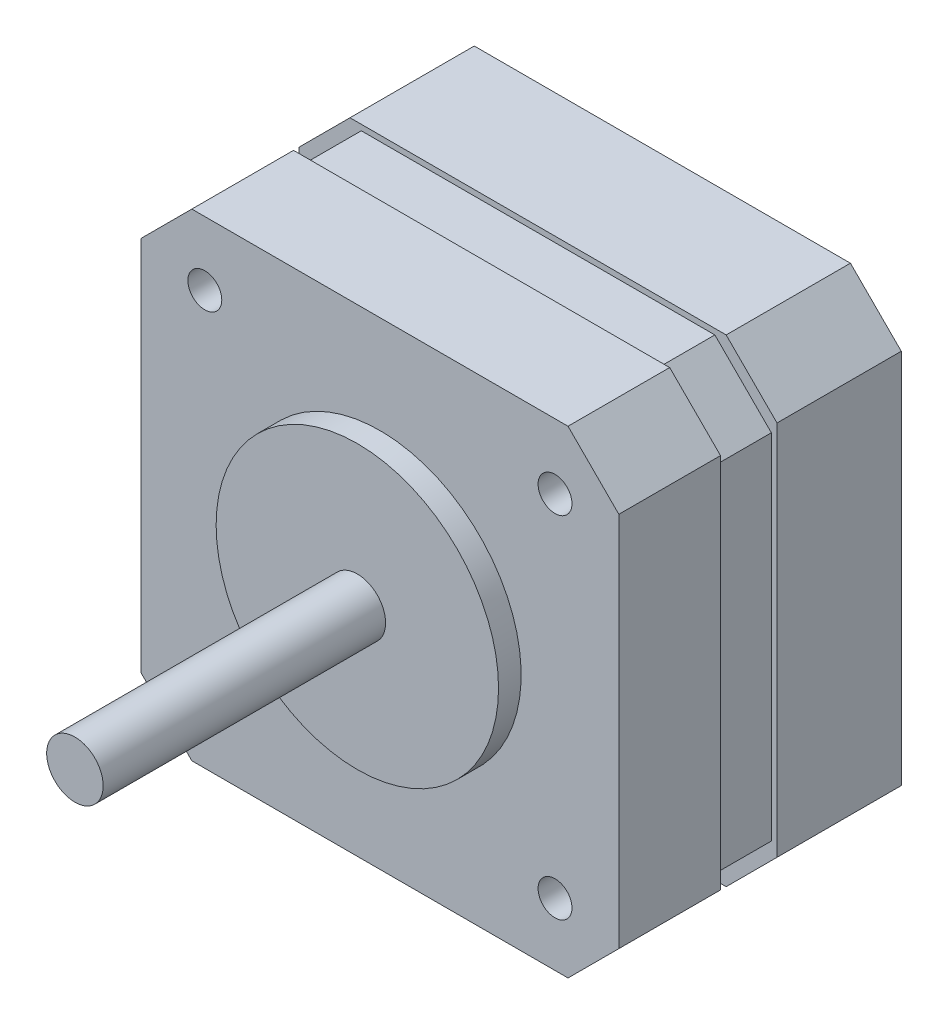
ISO-10303-21;
HEADER;
FILE_DESCRIPTION(('STEP AP214'),'2;1');
FILE_NAME('part.step','',(''),(''),'','','');
FILE_SCHEMA(('AUTOMOTIVE_DESIGN { 1 0 10303 214 1 1 1 1 }'));
ENDSEC;
DATA;
#1=APPLICATION_CONTEXT('core data for automotive mechanical design processes');
#2=APPLICATION_PROTOCOL_DEFINITION('international standard','automotive_design',2000,#1);
#3=PRODUCT_CONTEXT('',#1,'mechanical');
#4=PRODUCT('Part','Part','',(#3));
#5=PRODUCT_RELATED_PRODUCT_CATEGORY('part','',(#4));
#6=PRODUCT_DEFINITION_FORMATION('','',#4);
#7=PRODUCT_DEFINITION_CONTEXT('part definition',#1,'design');
#8=PRODUCT_DEFINITION('design','',#6,#7);
#9=PRODUCT_DEFINITION_SHAPE('','',#8);
#10=(LENGTH_UNIT() NAMED_UNIT(*) SI_UNIT(.MILLI.,.METRE.));
#11=(NAMED_UNIT(*) PLANE_ANGLE_UNIT() SI_UNIT($,.RADIAN.));
#12=(NAMED_UNIT(*) SI_UNIT($,.STERADIAN.) SOLID_ANGLE_UNIT());
#13=UNCERTAINTY_MEASURE_WITH_UNIT(LENGTH_MEASURE(1.E-05),#10,'distance_accuracy_value','');
#14=(GEOMETRIC_REPRESENTATION_CONTEXT(3) GLOBAL_UNCERTAINTY_ASSIGNED_CONTEXT((#13)) GLOBAL_UNIT_ASSIGNED_CONTEXT((#10,
#11,#12)) REPRESENTATION_CONTEXT('',''));
#15=CARTESIAN_POINT('',(0.,0.,0.));
#16=DIRECTION('',(0.,0.,1.));
#17=DIRECTION('',(1.,0.,0.));
#18=AXIS2_PLACEMENT_3D('',#15,#16,#17);
#19=CARTESIAN_POINT('',(21.15,21.15,27.));
#20=DIRECTION('',(0.,0.,1.));
#21=DIRECTION('',(1.,0.,0.));
#22=AXIS2_PLACEMENT_3D('',#19,#20,#21);
#23=PLANE('',#22);
#24=CARTESIAN_POINT('',(21.15,21.15,27.));
#25=DIRECTION('',(0.,0.,1.));
#26=DIRECTION('',(1.,0.,0.));
#27=AXIS2_PLACEMENT_3D('',#24,#25,#26);
#28=CIRCLE('',#27,12.5);
#29=CARTESIAN_POINT('',(33.65,21.15,27.));
#30=VERTEX_POINT('',#29);
#31=EDGE_CURVE('E513',#30,#30,#28,.T.);
#32=ORIENTED_EDGE('',*,*,#31,.T.);
#33=EDGE_LOOP('',(#32));
#34=FACE_BOUND('',#33,.T.);
#35=CARTESIAN_POINT('',(21.15,21.15,27.));
#36=DIRECTION('',(0.,0.,1.));
#37=DIRECTION('',(1.,0.,0.));
#38=AXIS2_PLACEMENT_3D('',#35,#36,#37);
#39=CIRCLE('',#38,2.5);
#40=CARTESIAN_POINT('',(23.65,21.15,27.));
#41=VERTEX_POINT('',#40);
#42=EDGE_CURVE('E558',#41,#41,#39,.T.);
#43=ORIENTED_EDGE('',*,*,#42,.F.);
#44=EDGE_LOOP('',(#43));
#45=FACE_BOUND('',#44,.T.);
#46=ADVANCED_FACE('F32',(#34,#45),#23,.T.);
#47=CARTESIAN_POINT('',(0.,42.3,25.));
#48=DIRECTION('',(0.,0.,-1.));
#49=DIRECTION('',(-1.,0.,0.));
#50=AXIS2_PLACEMENT_3D('',#47,#48,#49);
#51=PLANE('',#50);
#52=CARTESIAN_POINT('',(36.65,36.5364371724971,25.));
#53=DIRECTION('',(0.,0.,1.));
#54=DIRECTION('',(1.,0.,0.));
#55=AXIS2_PLACEMENT_3D('',#52,#53,#54);
#56=CIRCLE('',#55,1.5);
#57=CARTESIAN_POINT('',(38.15,36.5364371724971,25.));
#58=VERTEX_POINT('',#57);
#59=EDGE_CURVE('E583',#58,#58,#56,.T.);
#60=ORIENTED_EDGE('',*,*,#59,.F.);
#61=EDGE_LOOP('',(#60));
#62=FACE_BOUND('',#61,.T.);
#63=CARTESIAN_POINT('',(36.65,5.53643717249706,25.));
#64=DIRECTION('',(0.,0.,1.));
#65=DIRECTION('',(1.,0.,0.));
#66=AXIS2_PLACEMENT_3D('',#63,#64,#65);
#67=CIRCLE('',#66,1.5);
#68=CARTESIAN_POINT('',(38.15,5.53643717249706,25.));
#69=VERTEX_POINT('',#68);
#70=EDGE_CURVE('E577',#69,#69,#67,.T.);
#71=ORIENTED_EDGE('',*,*,#70,.F.);
#72=EDGE_LOOP('',(#71));
#73=FACE_BOUND('',#72,.T.);
#74=CARTESIAN_POINT('',(5.65,5.65,25.));
#75=DIRECTION('',(0.,0.,1.));
#76=DIRECTION('',(1.,0.,0.));
#77=AXIS2_PLACEMENT_3D('',#74,#75,#76);
#78=CIRCLE('',#77,1.5);
#79=CARTESIAN_POINT('',(7.15,5.65,25.));
#80=VERTEX_POINT('',#79);
#81=EDGE_CURVE('E571',#80,#80,#78,.T.);
#82=ORIENTED_EDGE('',*,*,#81,.F.);
#83=EDGE_LOOP('',(#82));
#84=FACE_BOUND('',#83,.T.);
#85=CARTESIAN_POINT('',(5.65,36.65,25.));
#86=DIRECTION('',(0.,0.,1.));
#87=DIRECTION('',(1.,0.,0.));
#88=AXIS2_PLACEMENT_3D('',#85,#86,#87);
#89=CIRCLE('',#88,1.5);
#90=CARTESIAN_POINT('',(7.15,36.65,25.));
#91=VERTEX_POINT('',#90);
#92=EDGE_CURVE('E565',#91,#91,#89,.T.);
#93=ORIENTED_EDGE('',*,*,#92,.F.);
#94=EDGE_LOOP('',(#93));
#95=FACE_BOUND('',#94,.T.);
#96=DIRECTION('',(0.,-1.,0.));
#97=VECTOR('',#96,1.);
#98=CARTESIAN_POINT('',(0.,0.,25.));
#99=LINE('',#98,#97);
#100=CARTESIAN_POINT('',(0.,37.8,25.));
#101=VERTEX_POINT('',#100);
#102=CARTESIAN_POINT('',(0.,4.50000000000001,25.));
#103=VERTEX_POINT('',#102);
#104=EDGE_CURVE('E499',#101,#103,#99,.T.);
#105=ORIENTED_EDGE('',*,*,#104,.T.);
#106=DIRECTION('',(-0.707106781186546,0.707106781186549,0.));
#107=VECTOR('',#106,1.);
#108=CARTESIAN_POINT('',(4.5,0.,25.));
#109=LINE('',#108,#107);
#110=CARTESIAN_POINT('',(4.5,0.,25.));
#111=VERTEX_POINT('',#110);
#112=EDGE_CURVE('E336',#103,#111,#109,.F.);
#113=ORIENTED_EDGE('',*,*,#112,.T.);
#114=DIRECTION('',(1.,0.,0.));
#115=VECTOR('',#114,1.);
#116=CARTESIAN_POINT('',(0.,0.,25.));
#117=LINE('',#116,#115);
#118=CARTESIAN_POINT('',(37.8,0.,25.));
#119=VERTEX_POINT('',#118);
#120=EDGE_CURVE('E504',#111,#119,#117,.T.);
#121=ORIENTED_EDGE('',*,*,#120,.T.);
#122=DIRECTION('',(-0.707106781186549,-0.707106781186546,0.));
#123=VECTOR('',#122,1.);
#124=CARTESIAN_POINT('',(42.3,4.5,25.));
#125=LINE('',#124,#123);
#126=CARTESIAN_POINT('',(42.3,4.5,25.));
#127=VERTEX_POINT('',#126);
#128=EDGE_CURVE('E334',#119,#127,#125,.F.);
#129=ORIENTED_EDGE('',*,*,#128,.T.);
#130=DIRECTION('',(0.,1.,0.));
#131=VECTOR('',#130,1.);
#132=CARTESIAN_POINT('',(42.3,0.,25.));
#133=LINE('',#132,#131);
#134=CARTESIAN_POINT('',(42.3,37.8,25.));
#135=VERTEX_POINT('',#134);
#136=EDGE_CURVE('E508',#127,#135,#133,.T.);
#137=ORIENTED_EDGE('',*,*,#136,.T.);
#138=DIRECTION('',(0.707106781186546,-0.707106781186549,0.));
#139=VECTOR('',#138,1.);
#140=CARTESIAN_POINT('',(37.8,42.3,25.));
#141=LINE('',#140,#139);
#142=CARTESIAN_POINT('',(37.8,42.3,25.));
#143=VERTEX_POINT('',#142);
#144=EDGE_CURVE('E54',#135,#143,#141,.F.);
#145=ORIENTED_EDGE('',*,*,#144,.T.);
#146=DIRECTION('',(-1.,0.,0.));
#147=VECTOR('',#146,1.);
#148=CARTESIAN_POINT('',(0.,42.3,25.));
#149=LINE('',#148,#147);
#150=CARTESIAN_POINT('',(4.50000000000003,42.3,25.));
#151=VERTEX_POINT('',#150);
#152=EDGE_CURVE('E227',#143,#151,#149,.T.);
#153=ORIENTED_EDGE('',*,*,#152,.T.);
#154=DIRECTION('',(0.707106781186549,0.707106781186546,0.));
#155=VECTOR('',#154,1.);
#156=CARTESIAN_POINT('',(0.,37.8,25.));
#157=LINE('',#156,#155);
#158=EDGE_CURVE('E332',#151,#101,#157,.F.);
#159=ORIENTED_EDGE('',*,*,#158,.T.);
#160=EDGE_LOOP('',(#105,#113,#121,#129,#137,#145,#153,#159));
#161=FACE_BOUND('',#160,.T.);
#162=CARTESIAN_POINT('',(21.15,21.15,25.));
#163=DIRECTION('',(0.,0.,-1.));
#164=DIRECTION('',(-1.,0.,0.));
#165=AXIS2_PLACEMENT_3D('',#162,#163,#164);
#166=CIRCLE('',#165,12.5);
#167=CARTESIAN_POINT('',(8.65,21.15,25.));
#168=VERTEX_POINT('',#167);
#169=EDGE_CURVE('E247',#168,#168,#166,.F.);
#170=ORIENTED_EDGE('',*,*,#169,.F.);
#171=EDGE_LOOP('',(#170));
#172=FACE_BOUND('',#171,.T.);
#173=ADVANCED_FACE('F400',(#62,#73,#84,#95,#161,#172),#51,.F.);
#174=CARTESIAN_POINT('',(0.,42.3,11.));
#175=DIRECTION('',(0.,0.,-1.));
#176=DIRECTION('',(-1.,0.,0.));
#177=AXIS2_PLACEMENT_3D('',#174,#175,#176);
#178=PLANE('',#177);
#179=DIRECTION('',(0.,-1.,0.));
#180=VECTOR('',#179,1.);
#181=CARTESIAN_POINT('',(0.,0.,11.));
#182=LINE('',#181,#180);
#183=CARTESIAN_POINT('',(0.,37.8,11.));
#184=VERTEX_POINT('',#183);
#185=CARTESIAN_POINT('',(0.,4.50000000000001,11.));
#186=VERTEX_POINT('',#185);
#187=EDGE_CURVE('E234',#184,#186,#182,.T.);
#188=ORIENTED_EDGE('',*,*,#187,.T.);
#189=DIRECTION('',(-0.707106781186546,0.707106781186549,0.));
#190=VECTOR('',#189,1.);
#191=CARTESIAN_POINT('',(4.5,0.,11.));
#192=LINE('',#191,#190);
#193=CARTESIAN_POINT('',(4.5,0.,11.));
#194=VERTEX_POINT('',#193);
#195=EDGE_CURVE('E311',#186,#194,#192,.F.);
#196=ORIENTED_EDGE('',*,*,#195,.T.);
#197=DIRECTION('',(1.,0.,0.));
#198=VECTOR('',#197,1.);
#199=CARTESIAN_POINT('',(0.,0.,11.));
#200=LINE('',#199,#198);
#201=CARTESIAN_POINT('',(37.8,0.,11.));
#202=VERTEX_POINT('',#201);
#203=EDGE_CURVE('E237',#194,#202,#200,.T.);
#204=ORIENTED_EDGE('',*,*,#203,.T.);
#205=DIRECTION('',(-0.707106781186549,-0.707106781186546,0.));
#206=VECTOR('',#205,1.);
#207=CARTESIAN_POINT('',(42.3,4.5,11.));
#208=LINE('',#207,#206);
#209=CARTESIAN_POINT('',(42.3,4.5,11.));
#210=VERTEX_POINT('',#209);
#211=EDGE_CURVE('E309',#202,#210,#208,.F.);
#212=ORIENTED_EDGE('',*,*,#211,.T.);
#213=DIRECTION('',(0.,1.,0.));
#214=VECTOR('',#213,1.);
#215=CARTESIAN_POINT('',(42.3,0.,11.));
#216=LINE('',#215,#214);
#217=CARTESIAN_POINT('',(42.3,37.8,11.));
#218=VERTEX_POINT('',#217);
#219=EDGE_CURVE('E241',#210,#218,#216,.T.);
#220=ORIENTED_EDGE('',*,*,#219,.T.);
#221=DIRECTION('',(0.707106781186546,-0.707106781186549,0.));
#222=VECTOR('',#221,1.);
#223=CARTESIAN_POINT('',(37.8,42.3,11.));
#224=LINE('',#223,#222);
#225=CARTESIAN_POINT('',(37.8,42.3,11.));
#226=VERTEX_POINT('',#225);
#227=EDGE_CURVE('E305',#218,#226,#224,.F.);
#228=ORIENTED_EDGE('',*,*,#227,.T.);
#229=DIRECTION('',(-1.,0.,0.));
#230=VECTOR('',#229,1.);
#231=CARTESIAN_POINT('',(0.,42.3,11.));
#232=LINE('',#231,#230);
#233=CARTESIAN_POINT('',(4.50000000000003,42.3,11.));
#234=VERTEX_POINT('',#233);
#235=EDGE_CURVE('E244',#226,#234,#232,.T.);
#236=ORIENTED_EDGE('',*,*,#235,.T.);
#237=DIRECTION('',(0.707106781186549,0.707106781186546,0.));
#238=VECTOR('',#237,1.);
#239=CARTESIAN_POINT('',(0.,37.8,11.));
#240=LINE('',#239,#238);
#241=EDGE_CURVE('E307',#234,#184,#240,.F.);
#242=ORIENTED_EDGE('',*,*,#241,.T.);
#243=EDGE_LOOP('',(#188,#196,#204,#212,#220,#228,#236,#242));
#244=FACE_BOUND('',#243,.T.);
#245=DIRECTION('',(0.,-1.,0.));
#246=VECTOR('',#245,1.);
#247=CARTESIAN_POINT('',(0.5,0.5,11.));
#248=LINE('',#247,#246);
#249=CARTESIAN_POINT('',(0.5,36.8,11.));
#250=VERTEX_POINT('',#249);
#251=CARTESIAN_POINT('',(0.5,5.50000000000001,11.));
#252=VERTEX_POINT('',#251);
#253=EDGE_CURVE('E222',#250,#252,#248,.T.);
#254=ORIENTED_EDGE('',*,*,#253,.F.);
#255=DIRECTION('',(-0.70710678118655,-0.707106781186545,0.));
#256=VECTOR('',#255,1.);
#257=CARTESIAN_POINT('',(2.99999999999999,39.3,11.));
#258=LINE('',#257,#256);
#259=CARTESIAN_POINT('',(5.50000000000002,41.8,11.));
#260=VERTEX_POINT('',#259);
#261=EDGE_CURVE('E279',#250,#260,#258,.F.);
#262=ORIENTED_EDGE('',*,*,#261,.T.);
#263=DIRECTION('',(-1.,0.,0.));
#264=VECTOR('',#263,1.);
#265=CARTESIAN_POINT('',(0.5,41.8,11.));
#266=LINE('',#265,#264);
#267=CARTESIAN_POINT('',(36.8,41.8,11.));
#268=VERTEX_POINT('',#267);
#269=EDGE_CURVE('E225',#268,#260,#266,.T.);
#270=ORIENTED_EDGE('',*,*,#269,.F.);
#271=DIRECTION('',(-0.707106781186545,0.70710678118655,0.));
#272=VECTOR('',#271,1.);
#273=CARTESIAN_POINT('',(18.1500000000001,60.45,11.));
#274=LINE('',#273,#272);
#275=CARTESIAN_POINT('',(41.8,36.8,11.));
#276=VERTEX_POINT('',#275);
#277=EDGE_CURVE('E283',#268,#276,#274,.F.);
#278=ORIENTED_EDGE('',*,*,#277,.T.);
#279=DIRECTION('',(0.,1.,0.));
#280=VECTOR('',#279,1.);
#281=CARTESIAN_POINT('',(41.8,0.5,11.));
#282=LINE('',#281,#280);
#283=CARTESIAN_POINT('',(41.8,5.5,11.));
#284=VERTEX_POINT('',#283);
#285=EDGE_CURVE('E221',#284,#276,#282,.T.);
#286=ORIENTED_EDGE('',*,*,#285,.F.);
#287=DIRECTION('',(0.707106781186549,0.707106781186547,0.));
#288=VECTOR('',#287,1.);
#289=CARTESIAN_POINT('',(39.2999999999999,2.99999999999995,11.));
#290=LINE('',#289,#288);
#291=CARTESIAN_POINT('',(36.8,0.5,11.));
#292=VERTEX_POINT('',#291);
#293=EDGE_CURVE('E220',#284,#292,#290,.F.);
#294=ORIENTED_EDGE('',*,*,#293,.T.);
#295=DIRECTION('',(1.,0.,0.));
#296=VECTOR('',#295,1.);
#297=CARTESIAN_POINT('',(0.5,0.5,11.));
#298=LINE('',#297,#296);
#299=CARTESIAN_POINT('',(5.5,0.5,11.));
#300=VERTEX_POINT('',#299);
#301=EDGE_CURVE('E211',#300,#292,#298,.T.);
#302=ORIENTED_EDGE('',*,*,#301,.F.);
#303=DIRECTION('',(0.707106781186547,-0.707106781186549,0.));
#304=VECTOR('',#303,1.);
#305=CARTESIAN_POINT('',(-18.15,24.1500000000001,11.));
#306=LINE('',#305,#304);
#307=EDGE_CURVE('E194',#300,#252,#306,.F.);
#308=ORIENTED_EDGE('',*,*,#307,.T.);
#309=EDGE_LOOP('',(#254,#262,#270,#278,#286,#294,#302,#308));
#310=FACE_BOUND('',#309,.T.);
#311=ADVANCED_FACE('F218',(#244,#310),#178,.F.);
#312=CARTESIAN_POINT('',(0.,0.,11.));
#313=DIRECTION('',(1.,0.,0.));
#314=DIRECTION('',(0.,0.,-1.));
#315=AXIS2_PLACEMENT_3D('',#312,#313,#314);
#316=PLANE('',#315);
#317=DIRECTION('',(0.,-1.,0.));
#318=VECTOR('',#317,1.);
#319=CARTESIAN_POINT('',(0.,0.,0.));
#320=LINE('',#319,#318);
#321=CARTESIAN_POINT('',(0.,37.8,0.));
#322=VERTEX_POINT('',#321);
#323=CARTESIAN_POINT('',(0.,4.50000000000001,0.));
#324=VERTEX_POINT('',#323);
#325=EDGE_CURVE('E248',#322,#324,#320,.T.);
#326=ORIENTED_EDGE('',*,*,#325,.T.);
#327=DIRECTION('',(0.,0.,1.));
#328=VECTOR('',#327,1.);
#329=CARTESIAN_POINT('',(0.,4.50000000000001,11.));
#330=LINE('',#329,#328);
#331=EDGE_CURVE('E303',#324,#186,#330,.T.);
#332=ORIENTED_EDGE('',*,*,#331,.T.);
#333=ORIENTED_EDGE('',*,*,#187,.F.);
#334=DIRECTION('',(0.,0.,-1.));
#335=VECTOR('',#334,1.);
#336=CARTESIAN_POINT('',(0.,37.8,11.));
#337=LINE('',#336,#335);
#338=EDGE_CURVE('E300',#184,#322,#337,.T.);
#339=ORIENTED_EDGE('',*,*,#338,.T.);
#340=EDGE_LOOP('',(#326,#332,#333,#339));
#341=FACE_BOUND('',#340,.T.);
#342=ADVANCED_FACE('F371',(#341),#316,.F.);
#343=CARTESIAN_POINT('',(0.,0.,11.));
#344=DIRECTION('',(0.,1.,0.));
#345=DIRECTION('',(0.,0.,1.));
#346=AXIS2_PLACEMENT_3D('',#343,#344,#345);
#347=PLANE('',#346);
#348=ORIENTED_EDGE('',*,*,#203,.F.);
#349=DIRECTION('',(0.,0.,-1.));
#350=VECTOR('',#349,1.);
#351=CARTESIAN_POINT('',(4.5,0.,11.));
#352=LINE('',#351,#350);
#353=CARTESIAN_POINT('',(4.50000000000001,0.,0.));
#354=VERTEX_POINT('',#353);
#355=EDGE_CURVE('E289',#194,#354,#352,.T.);
#356=ORIENTED_EDGE('',*,*,#355,.T.);
#357=DIRECTION('',(1.,0.,0.));
#358=VECTOR('',#357,1.);
#359=CARTESIAN_POINT('',(0.,0.,0.));
#360=LINE('',#359,#358);
#361=CARTESIAN_POINT('',(37.8,0.,0.));
#362=VERTEX_POINT('',#361);
#363=EDGE_CURVE('E251',#354,#362,#360,.T.);
#364=ORIENTED_EDGE('',*,*,#363,.T.);
#365=DIRECTION('',(0.,0.,1.));
#366=VECTOR('',#365,1.);
#367=CARTESIAN_POINT('',(37.8,0.,11.));
#368=LINE('',#367,#366);
#369=EDGE_CURVE('E287',#362,#202,#368,.T.);
#370=ORIENTED_EDGE('',*,*,#369,.T.);
#371=EDGE_LOOP('',(#348,#356,#364,#370));
#372=FACE_BOUND('',#371,.T.);
#373=ADVANCED_FACE('F380',(#372),#347,.F.);
#374=CARTESIAN_POINT('',(42.3,0.,11.));
#375=DIRECTION('',(-1.,0.,0.));
#376=DIRECTION('',(0.,0.,1.));
#377=AXIS2_PLACEMENT_3D('',#374,#375,#376);
#378=PLANE('',#377);
#379=ORIENTED_EDGE('',*,*,#219,.F.);
#380=DIRECTION('',(0.,0.,-1.));
#381=VECTOR('',#380,1.);
#382=CARTESIAN_POINT('',(42.3,4.5,11.));
#383=LINE('',#382,#381);
#384=CARTESIAN_POINT('',(42.3,4.5,0.));
#385=VERTEX_POINT('',#384);
#386=EDGE_CURVE('E340',#210,#385,#383,.T.);
#387=ORIENTED_EDGE('',*,*,#386,.T.);
#388=DIRECTION('',(0.,1.,0.));
#389=VECTOR('',#388,1.);
#390=CARTESIAN_POINT('',(42.3,0.,0.));
#391=LINE('',#390,#389);
#392=CARTESIAN_POINT('',(42.3,37.8,0.));
#393=VERTEX_POINT('',#392);
#394=EDGE_CURVE('E255',#385,#393,#391,.T.);
#395=ORIENTED_EDGE('',*,*,#394,.T.);
#396=DIRECTION('',(0.,0.,1.));
#397=VECTOR('',#396,1.);
#398=CARTESIAN_POINT('',(42.3,37.8,11.));
#399=LINE('',#398,#397);
#400=EDGE_CURVE('E338',#393,#218,#399,.T.);
#401=ORIENTED_EDGE('',*,*,#400,.T.);
#402=EDGE_LOOP('',(#379,#387,#395,#401));
#403=FACE_BOUND('',#402,.T.);
#404=ADVANCED_FACE('F388',(#403),#378,.F.);
#405=CARTESIAN_POINT('',(0.,42.3,11.));
#406=DIRECTION('',(0.,-1.,0.));
#407=DIRECTION('',(0.,0.,-1.));
#408=AXIS2_PLACEMENT_3D('',#405,#406,#407);
#409=PLANE('',#408);
#410=DIRECTION('',(-1.,0.,0.));
#411=VECTOR('',#410,1.);
#412=CARTESIAN_POINT('',(0.,42.3,0.));
#413=LINE('',#412,#411);
#414=CARTESIAN_POINT('',(37.8,42.3,0.));
#415=VERTEX_POINT('',#414);
#416=CARTESIAN_POINT('',(4.50000000000003,42.3,0.));
#417=VERTEX_POINT('',#416);
#418=EDGE_CURVE('E238',#415,#417,#413,.T.);
#419=ORIENTED_EDGE('',*,*,#418,.T.);
#420=DIRECTION('',(0.,0.,1.));
#421=VECTOR('',#420,1.);
#422=CARTESIAN_POINT('',(4.50000000000003,42.3,11.));
#423=LINE('',#422,#421);
#424=EDGE_CURVE('E11',#417,#234,#423,.T.);
#425=ORIENTED_EDGE('',*,*,#424,.T.);
#426=ORIENTED_EDGE('',*,*,#235,.F.);
#427=DIRECTION('',(0.,0.,-1.));
#428=VECTOR('',#427,1.);
#429=CARTESIAN_POINT('',(37.8,42.3,11.));
#430=LINE('',#429,#428);
#431=EDGE_CURVE('E40',#226,#415,#430,.T.);
#432=ORIENTED_EDGE('',*,*,#431,.T.);
#433=EDGE_LOOP('',(#419,#425,#426,#432));
#434=FACE_BOUND('',#433,.T.);
#435=ADVANCED_FACE('F356',(#434),#409,.F.);
#436=CARTESIAN_POINT('',(0.,42.3,0.));
#437=DIRECTION('',(0.,0.,-1.));
#438=DIRECTION('',(-1.,0.,0.));
#439=AXIS2_PLACEMENT_3D('',#436,#437,#438);
#440=PLANE('',#439);
#441=ORIENTED_EDGE('',*,*,#363,.F.);
#442=DIRECTION('',(0.707106781186546,-0.707106781186549,0.));
#443=VECTOR('',#442,1.);
#444=CARTESIAN_POINT('',(-18.9,23.4000000000001,0.));
#445=LINE('',#444,#443);
#446=EDGE_CURVE('E298',#354,#324,#445,.F.);
#447=ORIENTED_EDGE('',*,*,#446,.T.);
#448=ORIENTED_EDGE('',*,*,#325,.F.);
#449=DIRECTION('',(-0.707106781186549,-0.707106781186546,0.));
#450=VECTOR('',#449,1.);
#451=CARTESIAN_POINT('',(2.25,40.05,0.));
#452=LINE('',#451,#450);
#453=EDGE_CURVE('E294',#322,#417,#452,.F.);
#454=ORIENTED_EDGE('',*,*,#453,.T.);
#455=ORIENTED_EDGE('',*,*,#418,.F.);
#456=DIRECTION('',(-0.707106781186546,0.707106781186549,0.));
#457=VECTOR('',#456,1.);
#458=CARTESIAN_POINT('',(18.9,61.2,0.));
#459=LINE('',#458,#457);
#460=EDGE_CURVE('E292',#415,#393,#459,.F.);
#461=ORIENTED_EDGE('',*,*,#460,.T.);
#462=ORIENTED_EDGE('',*,*,#394,.F.);
#463=DIRECTION('',(0.707106781186549,0.707106781186546,0.));
#464=VECTOR('',#463,1.);
#465=CARTESIAN_POINT('',(40.0499999999999,2.24999999999994,0.));
#466=LINE('',#465,#464);
#467=EDGE_CURVE('E296',#385,#362,#466,.F.);
#468=ORIENTED_EDGE('',*,*,#467,.T.);
#469=EDGE_LOOP('',(#441,#447,#448,#454,#455,#461,#462,#468));
#470=FACE_BOUND('',#469,.T.);
#471=ADVANCED_FACE('F362',(#470),#440,.T.);
#472=CARTESIAN_POINT('',(0.5,0.5,16.));
#473=DIRECTION('',(1.,0.,0.));
#474=DIRECTION('',(0.,0.,-1.));
#475=AXIS2_PLACEMENT_3D('',#472,#473,#474);
#476=PLANE('',#475);
#477=ORIENTED_EDGE('',*,*,#253,.T.);
#478=DIRECTION('',(0.,0.,1.));
#479=VECTOR('',#478,1.);
#480=CARTESIAN_POINT('',(0.5,5.50000000000001,16.));
#481=LINE('',#480,#479);
#482=CARTESIAN_POINT('',(0.5,5.50000000000001,16.));
#483=VERTEX_POINT('',#482);
#484=EDGE_CURVE('E199',#252,#483,#481,.T.);
#485=ORIENTED_EDGE('',*,*,#484,.T.);
#486=DIRECTION('',(0.,-1.,0.));
#487=VECTOR('',#486,1.);
#488=CARTESIAN_POINT('',(0.5,0.5,16.));
#489=LINE('',#488,#487);
#490=CARTESIAN_POINT('',(0.5,36.8,16.));
#491=VERTEX_POINT('',#490);
#492=EDGE_CURVE('E233',#491,#483,#489,.T.);
#493=ORIENTED_EDGE('',*,*,#492,.F.);
#494=DIRECTION('',(0.,0.,-1.));
#495=VECTOR('',#494,1.);
#496=CARTESIAN_POINT('',(0.5,36.8,16.));
#497=LINE('',#496,#495);
#498=EDGE_CURVE('E215',#491,#250,#497,.T.);
#499=ORIENTED_EDGE('',*,*,#498,.T.);
#500=EDGE_LOOP('',(#477,#485,#493,#499));
#501=FACE_BOUND('',#500,.T.);
#502=ADVANCED_FACE('F447',(#501),#476,.F.);
#503=CARTESIAN_POINT('',(0.5,0.5,16.));
#504=DIRECTION('',(0.,1.,0.));
#505=DIRECTION('',(0.,0.,1.));
#506=AXIS2_PLACEMENT_3D('',#503,#504,#505);
#507=PLANE('',#506);
#508=DIRECTION('',(1.,0.,0.));
#509=VECTOR('',#508,1.);
#510=CARTESIAN_POINT('',(0.5,0.5,16.));
#511=LINE('',#510,#509);
#512=CARTESIAN_POINT('',(5.5,0.5,16.));
#513=VERTEX_POINT('',#512);
#514=CARTESIAN_POINT('',(36.8,0.5,16.));
#515=VERTEX_POINT('',#514);
#516=EDGE_CURVE('E214',#513,#515,#511,.T.);
#517=ORIENTED_EDGE('',*,*,#516,.F.);
#518=DIRECTION('',(0.,0.,-1.));
#519=VECTOR('',#518,1.);
#520=CARTESIAN_POINT('',(5.5,0.5,16.));
#521=LINE('',#520,#519);
#522=EDGE_CURVE('E198',#513,#300,#521,.T.);
#523=ORIENTED_EDGE('',*,*,#522,.T.);
#524=ORIENTED_EDGE('',*,*,#301,.T.);
#525=DIRECTION('',(0.,0.,1.));
#526=VECTOR('',#525,1.);
#527=CARTESIAN_POINT('',(36.8,0.5,16.));
#528=LINE('',#527,#526);
#529=EDGE_CURVE('E216',#292,#515,#528,.T.);
#530=ORIENTED_EDGE('',*,*,#529,.T.);
#531=EDGE_LOOP('',(#517,#523,#524,#530));
#532=FACE_BOUND('',#531,.T.);
#533=ADVANCED_FACE('F210',(#532),#507,.F.);
#534=CARTESIAN_POINT('',(41.8,0.5,16.));
#535=DIRECTION('',(-1.,0.,0.));
#536=DIRECTION('',(0.,0.,1.));
#537=AXIS2_PLACEMENT_3D('',#534,#535,#536);
#538=PLANE('',#537);
#539=DIRECTION('',(0.,1.,0.));
#540=VECTOR('',#539,1.);
#541=CARTESIAN_POINT('',(41.8,0.5,16.));
#542=LINE('',#541,#540);
#543=CARTESIAN_POINT('',(41.8,5.5,16.));
#544=VERTEX_POINT('',#543);
#545=CARTESIAN_POINT('',(41.8,36.8,16.));
#546=VERTEX_POINT('',#545);
#547=EDGE_CURVE('E528',#544,#546,#542,.T.);
#548=ORIENTED_EDGE('',*,*,#547,.F.);
#549=DIRECTION('',(0.,0.,-1.));
#550=VECTOR('',#549,1.);
#551=CARTESIAN_POINT('',(41.8,5.5,16.));
#552=LINE('',#551,#550);
#553=EDGE_CURVE('E268',#544,#284,#552,.T.);
#554=ORIENTED_EDGE('',*,*,#553,.T.);
#555=ORIENTED_EDGE('',*,*,#285,.T.);
#556=DIRECTION('',(0.,0.,1.));
#557=VECTOR('',#556,1.);
#558=CARTESIAN_POINT('',(41.8,36.8,16.));
#559=LINE('',#558,#557);
#560=EDGE_CURVE('E266',#276,#546,#559,.T.);
#561=ORIENTED_EDGE('',*,*,#560,.T.);
#562=EDGE_LOOP('',(#548,#554,#555,#561));
#563=FACE_BOUND('',#562,.T.);
#564=ADVANCED_FACE('F440',(#563),#538,.F.);
#565=CARTESIAN_POINT('',(0.5,41.8,16.));
#566=DIRECTION('',(0.,-1.,0.));
#567=DIRECTION('',(0.,0.,-1.));
#568=AXIS2_PLACEMENT_3D('',#565,#566,#567);
#569=PLANE('',#568);
#570=ORIENTED_EDGE('',*,*,#269,.T.);
#571=DIRECTION('',(0.,0.,1.));
#572=VECTOR('',#571,1.);
#573=CARTESIAN_POINT('',(5.50000000000002,41.8,16.));
#574=LINE('',#573,#572);
#575=CARTESIAN_POINT('',(5.50000000000002,41.8,16.));
#576=VERTEX_POINT('',#575);
#577=EDGE_CURVE('E205',#260,#576,#574,.T.);
#578=ORIENTED_EDGE('',*,*,#577,.T.);
#579=DIRECTION('',(-1.,0.,0.));
#580=VECTOR('',#579,1.);
#581=CARTESIAN_POINT('',(0.5,41.8,16.));
#582=LINE('',#581,#580);
#583=CARTESIAN_POINT('',(36.8,41.8,16.));
#584=VERTEX_POINT('',#583);
#585=EDGE_CURVE('E252',#584,#576,#582,.T.);
#586=ORIENTED_EDGE('',*,*,#585,.F.);
#587=DIRECTION('',(0.,0.,-1.));
#588=VECTOR('',#587,1.);
#589=CARTESIAN_POINT('',(36.8,41.8,16.));
#590=LINE('',#589,#588);
#591=EDGE_CURVE('E271',#584,#268,#590,.T.);
#592=ORIENTED_EDGE('',*,*,#591,.T.);
#593=EDGE_LOOP('',(#570,#578,#586,#592));
#594=FACE_BOUND('',#593,.T.);
#595=ADVANCED_FACE('F423',(#594),#569,.F.);
#596=CARTESIAN_POINT('',(0.,42.3,16.));
#597=DIRECTION('',(0.,0.,-1.));
#598=DIRECTION('',(-1.,0.,0.));
#599=AXIS2_PLACEMENT_3D('',#596,#597,#598);
#600=PLANE('',#599);
#601=DIRECTION('',(1.,0.,0.));
#602=VECTOR('',#601,1.);
#603=CARTESIAN_POINT('',(0.,0.,16.));
#604=LINE('',#603,#602);
#605=CARTESIAN_POINT('',(4.50000000000001,0.,16.));
#606=VERTEX_POINT('',#605);
#607=CARTESIAN_POINT('',(37.8,0.,16.));
#608=VERTEX_POINT('',#607);
#609=EDGE_CURVE('E520',#606,#608,#604,.T.);
#610=ORIENTED_EDGE('',*,*,#609,.F.);
#611=DIRECTION('',(0.707106781186546,-0.707106781186549,0.));
#612=VECTOR('',#611,1.);
#613=CARTESIAN_POINT('',(-18.9,23.4000000000001,16.));
#614=LINE('',#613,#612);
#615=CARTESIAN_POINT('',(0.,4.50000000000001,16.));
#616=VERTEX_POINT('',#615);
#617=EDGE_CURVE('E324',#606,#616,#614,.F.);
#618=ORIENTED_EDGE('',*,*,#617,.T.);
#619=DIRECTION('',(0.,-1.,0.));
#620=VECTOR('',#619,1.);
#621=CARTESIAN_POINT('',(0.,0.,16.));
#622=LINE('',#621,#620);
#623=CARTESIAN_POINT('',(0.,37.8,16.));
#624=VERTEX_POINT('',#623);
#625=EDGE_CURVE('E518',#624,#616,#622,.T.);
#626=ORIENTED_EDGE('',*,*,#625,.F.);
#627=DIRECTION('',(-0.707106781186549,-0.707106781186546,0.));
#628=VECTOR('',#627,1.);
#629=CARTESIAN_POINT('',(2.25,40.05,16.));
#630=LINE('',#629,#628);
#631=CARTESIAN_POINT('',(4.50000000000003,42.3,16.));
#632=VERTEX_POINT('',#631);
#633=EDGE_CURVE('E320',#624,#632,#630,.F.);
#634=ORIENTED_EDGE('',*,*,#633,.T.);
#635=DIRECTION('',(-1.,0.,0.));
#636=VECTOR('',#635,1.);
#637=CARTESIAN_POINT('',(0.,42.3,16.));
#638=LINE('',#637,#636);
#639=CARTESIAN_POINT('',(37.8,42.3,16.));
#640=VERTEX_POINT('',#639);
#641=EDGE_CURVE('E505',#640,#632,#638,.T.);
#642=ORIENTED_EDGE('',*,*,#641,.F.);
#643=DIRECTION('',(-0.707106781186546,0.707106781186549,0.));
#644=VECTOR('',#643,1.);
#645=CARTESIAN_POINT('',(18.9,61.2,16.));
#646=LINE('',#645,#644);
#647=CARTESIAN_POINT('',(42.3,37.8,16.));
#648=VERTEX_POINT('',#647);
#649=EDGE_CURVE('E318',#640,#648,#646,.F.);
#650=ORIENTED_EDGE('',*,*,#649,.T.);
#651=DIRECTION('',(0.,1.,0.));
#652=VECTOR('',#651,1.);
#653=CARTESIAN_POINT('',(42.3,0.,16.));
#654=LINE('',#653,#652);
#655=CARTESIAN_POINT('',(42.3,4.5,16.));
#656=VERTEX_POINT('',#655);
#657=EDGE_CURVE('E510',#656,#648,#654,.T.);
#658=ORIENTED_EDGE('',*,*,#657,.F.);
#659=DIRECTION('',(0.707106781186549,0.707106781186546,0.));
#660=VECTOR('',#659,1.);
#661=CARTESIAN_POINT('',(40.0499999999999,2.24999999999994,16.));
#662=LINE('',#661,#660);
#663=EDGE_CURVE('E322',#656,#608,#662,.F.);
#664=ORIENTED_EDGE('',*,*,#663,.T.);
#665=EDGE_LOOP('',(#610,#618,#626,#634,#642,#650,#658,#664));
#666=FACE_BOUND('',#665,.T.);
#667=ORIENTED_EDGE('',*,*,#585,.T.);
#668=DIRECTION('',(0.70710678118655,0.707106781186545,0.));
#669=VECTOR('',#668,1.);
#670=CARTESIAN_POINT('',(0.5,36.8,16.));
#671=LINE('',#670,#669);
#672=EDGE_CURVE('E281',#576,#491,#671,.F.);
#673=ORIENTED_EDGE('',*,*,#672,.T.);
#674=ORIENTED_EDGE('',*,*,#492,.T.);
#675=DIRECTION('',(-0.707106781186547,0.707106781186549,0.));
#676=VECTOR('',#675,1.);
#677=CARTESIAN_POINT('',(5.5,0.5,16.));
#678=LINE('',#677,#676);
#679=EDGE_CURVE('E204',#483,#513,#678,.F.);
#680=ORIENTED_EDGE('',*,*,#679,.T.);
#681=ORIENTED_EDGE('',*,*,#516,.T.);
#682=DIRECTION('',(-0.707106781186549,-0.707106781186547,0.));
#683=VECTOR('',#682,1.);
#684=CARTESIAN_POINT('',(41.8,5.5,16.));
#685=LINE('',#684,#683);
#686=EDGE_CURVE('E277',#515,#544,#685,.F.);
#687=ORIENTED_EDGE('',*,*,#686,.T.);
#688=ORIENTED_EDGE('',*,*,#547,.T.);
#689=DIRECTION('',(0.707106781186545,-0.70710678118655,0.));
#690=VECTOR('',#689,1.);
#691=CARTESIAN_POINT('',(36.8,41.8,16.));
#692=LINE('',#691,#690);
#693=EDGE_CURVE('E285',#546,#584,#692,.F.);
#694=ORIENTED_EDGE('',*,*,#693,.T.);
#695=EDGE_LOOP('',(#667,#673,#674,#680,#681,#687,#688,#694));
#696=FACE_BOUND('',#695,.T.);
#697=ADVANCED_FACE('F419',(#666,#696),#600,.T.);
#698=CARTESIAN_POINT('',(0.,0.,25.));
#699=DIRECTION('',(1.,0.,0.));
#700=DIRECTION('',(0.,0.,-1.));
#701=AXIS2_PLACEMENT_3D('',#698,#699,#700);
#702=PLANE('',#701);
#703=ORIENTED_EDGE('',*,*,#625,.T.);
#704=DIRECTION('',(0.,0.,1.));
#705=VECTOR('',#704,1.);
#706=CARTESIAN_POINT('',(0.,4.50000000000001,25.));
#707=LINE('',#706,#705);
#708=EDGE_CURVE('E329',#616,#103,#707,.T.);
#709=ORIENTED_EDGE('',*,*,#708,.T.);
#710=ORIENTED_EDGE('',*,*,#104,.F.);
#711=DIRECTION('',(0.,0.,-1.));
#712=VECTOR('',#711,1.);
#713=CARTESIAN_POINT('',(0.,37.8,25.));
#714=LINE('',#713,#712);
#715=EDGE_CURVE('E326',#101,#624,#714,.T.);
#716=ORIENTED_EDGE('',*,*,#715,.T.);
#717=EDGE_LOOP('',(#703,#709,#710,#716));
#718=FACE_BOUND('',#717,.T.);
#719=ADVANCED_FACE('F422',(#718),#702,.F.);
#720=CARTESIAN_POINT('',(0.,0.,25.));
#721=DIRECTION('',(0.,1.,0.));
#722=DIRECTION('',(0.,0.,1.));
#723=AXIS2_PLACEMENT_3D('',#720,#721,#722);
#724=PLANE('',#723);
#725=ORIENTED_EDGE('',*,*,#120,.F.);
#726=DIRECTION('',(0.,0.,-1.));
#727=VECTOR('',#726,1.);
#728=CARTESIAN_POINT('',(4.5,0.,25.));
#729=LINE('',#728,#727);
#730=EDGE_CURVE('E315',#111,#606,#729,.T.);
#731=ORIENTED_EDGE('',*,*,#730,.T.);
#732=ORIENTED_EDGE('',*,*,#609,.T.);
#733=DIRECTION('',(0.,0.,1.));
#734=VECTOR('',#733,1.);
#735=CARTESIAN_POINT('',(37.8,0.,25.));
#736=LINE('',#735,#734);
#737=EDGE_CURVE('E313',#608,#119,#736,.T.);
#738=ORIENTED_EDGE('',*,*,#737,.T.);
#739=EDGE_LOOP('',(#725,#731,#732,#738));
#740=FACE_BOUND('',#739,.T.);
#741=ADVANCED_FACE('F430',(#740),#724,.F.);
#742=CARTESIAN_POINT('',(42.3,0.,25.));
#743=DIRECTION('',(-1.,0.,0.));
#744=DIRECTION('',(0.,0.,1.));
#745=AXIS2_PLACEMENT_3D('',#742,#743,#744);
#746=PLANE('',#745);
#747=ORIENTED_EDGE('',*,*,#136,.F.);
#748=DIRECTION('',(0.,0.,-1.));
#749=VECTOR('',#748,1.);
#750=CARTESIAN_POINT('',(42.3,4.5,25.));
#751=LINE('',#750,#749);
#752=EDGE_CURVE('E345',#127,#656,#751,.T.);
#753=ORIENTED_EDGE('',*,*,#752,.T.);
#754=ORIENTED_EDGE('',*,*,#657,.T.);
#755=DIRECTION('',(0.,0.,1.));
#756=VECTOR('',#755,1.);
#757=CARTESIAN_POINT('',(42.3,37.8,25.));
#758=LINE('',#757,#756);
#759=EDGE_CURVE('E343',#648,#135,#758,.T.);
#760=ORIENTED_EDGE('',*,*,#759,.T.);
#761=EDGE_LOOP('',(#747,#753,#754,#760));
#762=FACE_BOUND('',#761,.T.);
#763=ADVANCED_FACE('F427',(#762),#746,.F.);
#764=CARTESIAN_POINT('',(0.,42.3,25.));
#765=DIRECTION('',(0.,-1.,0.));
#766=DIRECTION('',(0.,0.,-1.));
#767=AXIS2_PLACEMENT_3D('',#764,#765,#766);
#768=PLANE('',#767);
#769=ORIENTED_EDGE('',*,*,#641,.T.);
#770=DIRECTION('',(0.,0.,1.));
#771=VECTOR('',#770,1.);
#772=CARTESIAN_POINT('',(4.50000000000003,42.3,25.));
#773=LINE('',#772,#771);
#774=EDGE_CURVE('E47',#632,#151,#773,.T.);
#775=ORIENTED_EDGE('',*,*,#774,.T.);
#776=ORIENTED_EDGE('',*,*,#152,.F.);
#777=DIRECTION('',(0.,0.,-1.));
#778=VECTOR('',#777,1.);
#779=CARTESIAN_POINT('',(37.8,42.3,25.));
#780=LINE('',#779,#778);
#781=EDGE_CURVE('E348',#143,#640,#780,.T.);
#782=ORIENTED_EDGE('',*,*,#781,.T.);
#783=EDGE_LOOP('',(#769,#775,#776,#782));
#784=FACE_BOUND('',#783,.T.);
#785=ADVANCED_FACE('F416',(#784),#768,.F.);
#786=CARTESIAN_POINT('',(21.15,21.15,27.));
#787=DIRECTION('',(0.,0.,-1.));
#788=DIRECTION('',(-1.,0.,0.));
#789=AXIS2_PLACEMENT_3D('',#786,#787,#788);
#790=CYLINDRICAL_SURFACE('',#789,12.5);
#791=ORIENTED_EDGE('',*,*,#31,.F.);
#792=EDGE_LOOP('',(#791));
#793=FACE_BOUND('',#792,.T.);
#794=ORIENTED_EDGE('',*,*,#169,.T.);
#795=EDGE_LOOP('',(#794));
#796=FACE_BOUND('',#795,.T.);
#797=ADVANCED_FACE('F414',(#793,#796),#790,.T.);
#798=CARTESIAN_POINT('',(21.15,21.15,52.));
#799=DIRECTION('',(0.,0.,-1.));
#800=DIRECTION('',(-1.,0.,0.));
#801=AXIS2_PLACEMENT_3D('',#798,#799,#800);
#802=CYLINDRICAL_SURFACE('',#801,2.5);
#803=CARTESIAN_POINT('',(21.15,21.15,52.));
#804=DIRECTION('',(0.,0.,1.));
#805=DIRECTION('',(1.,0.,0.));
#806=AXIS2_PLACEMENT_3D('',#803,#804,#805);
#807=CIRCLE('',#806,2.5);
#808=CARTESIAN_POINT('',(23.65,21.15,52.));
#809=VERTEX_POINT('',#808);
#810=EDGE_CURVE('E555',#809,#809,#807,.T.);
#811=ORIENTED_EDGE('',*,*,#810,.F.);
#812=EDGE_LOOP('',(#811));
#813=FACE_BOUND('',#812,.T.);
#814=ORIENTED_EDGE('',*,*,#42,.T.);
#815=EDGE_LOOP('',(#814));
#816=FACE_BOUND('',#815,.T.);
#817=ADVANCED_FACE('F412',(#813,#816),#802,.T.);
#818=CARTESIAN_POINT('',(21.15,21.15,52.));
#819=DIRECTION('',(0.,0.,1.));
#820=DIRECTION('',(1.,0.,0.));
#821=AXIS2_PLACEMENT_3D('',#818,#819,#820);
#822=PLANE('',#821);
#823=ORIENTED_EDGE('',*,*,#810,.T.);
#824=EDGE_LOOP('',(#823));
#825=FACE_BOUND('',#824,.T.);
#826=ADVANCED_FACE('F606',(#825),#822,.T.);
#827=CARTESIAN_POINT('',(5.65,36.65,10.));
#828=DIRECTION('',(0.,0.,1.));
#829=DIRECTION('',(1.,0.,0.));
#830=AXIS2_PLACEMENT_3D('',#827,#828,#829);
#831=CYLINDRICAL_SURFACE('',#830,1.5);
#832=CARTESIAN_POINT('',(5.65,36.65,10.));
#833=DIRECTION('',(0.,0.,1.));
#834=DIRECTION('',(1.,0.,0.));
#835=AXIS2_PLACEMENT_3D('',#832,#833,#834);
#836=CIRCLE('',#835,1.5);
#837=CARTESIAN_POINT('',(7.15,36.65,10.));
#838=VERTEX_POINT('',#837);
#839=EDGE_CURVE('E563',#838,#838,#836,.T.);
#840=ORIENTED_EDGE('',*,*,#839,.F.);
#841=EDGE_LOOP('',(#840));
#842=FACE_BOUND('',#841,.T.);
#843=ORIENTED_EDGE('',*,*,#92,.T.);
#844=EDGE_LOOP('',(#843));
#845=FACE_BOUND('',#844,.T.);
#846=ADVANCED_FACE('F603',(#842,#845),#831,.F.);
#847=CARTESIAN_POINT('',(5.65,36.65,10.));
#848=DIRECTION('',(0.,0.,1.));
#849=DIRECTION('',(1.,0.,0.));
#850=AXIS2_PLACEMENT_3D('',#847,#848,#849);
#851=PLANE('',#850);
#852=ORIENTED_EDGE('',*,*,#839,.T.);
#853=EDGE_LOOP('',(#852));
#854=FACE_BOUND('',#853,.T.);
#855=ADVANCED_FACE('F605',(#854),#851,.T.);
#856=CARTESIAN_POINT('',(5.65,5.65,10.));
#857=DIRECTION('',(0.,0.,1.));
#858=DIRECTION('',(1.,0.,0.));
#859=AXIS2_PLACEMENT_3D('',#856,#857,#858);
#860=CYLINDRICAL_SURFACE('',#859,1.5);
#861=CARTESIAN_POINT('',(5.65,5.65,10.));
#862=DIRECTION('',(0.,0.,1.));
#863=DIRECTION('',(1.,0.,0.));
#864=AXIS2_PLACEMENT_3D('',#861,#862,#863);
#865=CIRCLE('',#864,1.5);
#866=CARTESIAN_POINT('',(7.15,5.65,10.));
#867=VERTEX_POINT('',#866);
#868=EDGE_CURVE('E568',#867,#867,#865,.T.);
#869=ORIENTED_EDGE('',*,*,#868,.F.);
#870=EDGE_LOOP('',(#869));
#871=FACE_BOUND('',#870,.T.);
#872=ORIENTED_EDGE('',*,*,#81,.T.);
#873=EDGE_LOOP('',(#872));
#874=FACE_BOUND('',#873,.T.);
#875=ADVANCED_FACE('F613',(#871,#874),#860,.F.);
#876=CARTESIAN_POINT('',(5.65,5.65,10.));
#877=DIRECTION('',(0.,0.,1.));
#878=DIRECTION('',(1.,0.,0.));
#879=AXIS2_PLACEMENT_3D('',#876,#877,#878);
#880=PLANE('',#879);
#881=ORIENTED_EDGE('',*,*,#868,.T.);
#882=EDGE_LOOP('',(#881));
#883=FACE_BOUND('',#882,.T.);
#884=ADVANCED_FACE('F620',(#883),#880,.T.);
#885=CARTESIAN_POINT('',(36.65,5.53643717249706,10.));
#886=DIRECTION('',(0.,0.,1.));
#887=DIRECTION('',(1.,0.,0.));
#888=AXIS2_PLACEMENT_3D('',#885,#886,#887);
#889=CYLINDRICAL_SURFACE('',#888,1.5);
#890=CARTESIAN_POINT('',(36.65,5.53643717249706,10.));
#891=DIRECTION('',(0.,0.,1.));
#892=DIRECTION('',(1.,0.,0.));
#893=AXIS2_PLACEMENT_3D('',#890,#891,#892);
#894=CIRCLE('',#893,1.5);
#895=CARTESIAN_POINT('',(38.15,5.53643717249706,10.));
#896=VERTEX_POINT('',#895);
#897=EDGE_CURVE('E574',#896,#896,#894,.T.);
#898=ORIENTED_EDGE('',*,*,#897,.F.);
#899=EDGE_LOOP('',(#898));
#900=FACE_BOUND('',#899,.T.);
#901=ORIENTED_EDGE('',*,*,#70,.T.);
#902=EDGE_LOOP('',(#901));
#903=FACE_BOUND('',#902,.T.);
#904=ADVANCED_FACE('F624',(#900,#903),#889,.F.);
#905=CARTESIAN_POINT('',(36.65,5.53643717249706,10.));
#906=DIRECTION('',(0.,0.,1.));
#907=DIRECTION('',(1.,0.,0.));
#908=AXIS2_PLACEMENT_3D('',#905,#906,#907);
#909=PLANE('',#908);
#910=ORIENTED_EDGE('',*,*,#897,.T.);
#911=EDGE_LOOP('',(#910));
#912=FACE_BOUND('',#911,.T.);
#913=ADVANCED_FACE('F593',(#912),#909,.T.);
#914=CARTESIAN_POINT('',(36.65,36.5364371724971,10.));
#915=DIRECTION('',(0.,0.,1.));
#916=DIRECTION('',(1.,0.,0.));
#917=AXIS2_PLACEMENT_3D('',#914,#915,#916);
#918=CYLINDRICAL_SURFACE('',#917,1.5);
#919=CARTESIAN_POINT('',(36.65,36.5364371724971,10.));
#920=DIRECTION('',(0.,0.,1.));
#921=DIRECTION('',(1.,0.,0.));
#922=AXIS2_PLACEMENT_3D('',#919,#920,#921);
#923=CIRCLE('',#922,1.5);
#924=CARTESIAN_POINT('',(38.15,36.5364371724971,10.));
#925=VERTEX_POINT('',#924);
#926=EDGE_CURVE('E580',#925,#925,#923,.T.);
#927=ORIENTED_EDGE('',*,*,#926,.F.);
#928=EDGE_LOOP('',(#927));
#929=FACE_BOUND('',#928,.T.);
#930=ORIENTED_EDGE('',*,*,#59,.T.);
#931=EDGE_LOOP('',(#930));
#932=FACE_BOUND('',#931,.T.);
#933=ADVANCED_FACE('F590',(#929,#932),#918,.F.);
#934=CARTESIAN_POINT('',(36.65,36.5364371724971,10.));
#935=DIRECTION('',(0.,0.,1.));
#936=DIRECTION('',(1.,0.,0.));
#937=AXIS2_PLACEMENT_3D('',#934,#935,#936);
#938=PLANE('',#937);
#939=ORIENTED_EDGE('',*,*,#926,.T.);
#940=EDGE_LOOP('',(#939));
#941=FACE_BOUND('',#940,.T.);
#942=ADVANCED_FACE('F466',(#941),#938,.T.);
#943=CARTESIAN_POINT('',(5.5,0.5,16.));
#944=DIRECTION('',(0.707106781186548,0.707106781186546,0.));
#945=DIRECTION('',(-0.707106781186547,0.707106781186549,0.));
#946=AXIS2_PLACEMENT_3D('',#943,#944,#945);
#947=PLANE('',#946);
#948=ORIENTED_EDGE('',*,*,#679,.F.);
#949=ORIENTED_EDGE('',*,*,#484,.F.);
#950=ORIENTED_EDGE('',*,*,#307,.F.);
#951=ORIENTED_EDGE('',*,*,#522,.F.);
#952=EDGE_LOOP('',(#948,#949,#950,#951));
#953=FACE_BOUND('',#952,.T.);
#954=ADVANCED_FACE('F197',(#953),#947,.F.);
#955=CARTESIAN_POINT('',(41.8,5.5,16.));
#956=DIRECTION('',(-0.707106781186546,0.707106781186548,0.));
#957=DIRECTION('',(-0.707106781186549,-0.707106781186547,0.));
#958=AXIS2_PLACEMENT_3D('',#955,#956,#957);
#959=PLANE('',#958);
#960=ORIENTED_EDGE('',*,*,#686,.F.);
#961=ORIENTED_EDGE('',*,*,#529,.F.);
#962=ORIENTED_EDGE('',*,*,#293,.F.);
#963=ORIENTED_EDGE('',*,*,#553,.F.);
#964=EDGE_LOOP('',(#960,#961,#962,#963));
#965=FACE_BOUND('',#964,.T.);
#966=ADVANCED_FACE('F465',(#965),#959,.F.);
#967=CARTESIAN_POINT('',(0.5,36.8,16.));
#968=DIRECTION('',(0.707106781186545,-0.70710678118655,0.));
#969=DIRECTION('',(0.70710678118655,0.707106781186545,0.));
#970=AXIS2_PLACEMENT_3D('',#967,#968,#969);
#971=PLANE('',#970);
#972=ORIENTED_EDGE('',*,*,#672,.F.);
#973=ORIENTED_EDGE('',*,*,#577,.F.);
#974=ORIENTED_EDGE('',*,*,#261,.F.);
#975=ORIENTED_EDGE('',*,*,#498,.F.);
#976=EDGE_LOOP('',(#972,#973,#974,#975));
#977=FACE_BOUND('',#976,.T.);
#978=ADVANCED_FACE('F469',(#977),#971,.F.);
#979=CARTESIAN_POINT('',(36.8,41.8,16.));
#980=DIRECTION('',(-0.70710678118655,-0.707106781186545,0.));
#981=DIRECTION('',(0.707106781186545,-0.70710678118655,0.));
#982=AXIS2_PLACEMENT_3D('',#979,#980,#981);
#983=PLANE('',#982);
#984=ORIENTED_EDGE('',*,*,#693,.F.);
#985=ORIENTED_EDGE('',*,*,#560,.F.);
#986=ORIENTED_EDGE('',*,*,#277,.F.);
#987=ORIENTED_EDGE('',*,*,#591,.F.);
#988=EDGE_LOOP('',(#984,#985,#986,#987));
#989=FACE_BOUND('',#988,.T.);
#990=ADVANCED_FACE('F473',(#989),#983,.F.);
#991=CARTESIAN_POINT('',(4.5,0.,11.));
#992=DIRECTION('',(0.707106781186549,0.707106781186546,0.));
#993=DIRECTION('',(-0.707106781186546,0.707106781186549,0.));
#994=AXIS2_PLACEMENT_3D('',#991,#992,#993);
#995=PLANE('',#994);
#996=ORIENTED_EDGE('',*,*,#195,.F.);
#997=ORIENTED_EDGE('',*,*,#331,.F.);
#998=ORIENTED_EDGE('',*,*,#446,.F.);
#999=ORIENTED_EDGE('',*,*,#355,.F.);
#1000=EDGE_LOOP('',(#996,#997,#998,#999));
#1001=FACE_BOUND('',#1000,.T.);
#1002=ADVANCED_FACE('F378',(#1001),#995,.F.);
#1003=CARTESIAN_POINT('',(4.5,0.,25.));
#1004=DIRECTION('',(0.707106781186549,0.707106781186546,0.));
#1005=DIRECTION('',(-0.707106781186546,0.707106781186549,0.));
#1006=AXIS2_PLACEMENT_3D('',#1003,#1004,#1005);
#1007=PLANE('',#1006);
#1008=ORIENTED_EDGE('',*,*,#112,.F.);
#1009=ORIENTED_EDGE('',*,*,#708,.F.);
#1010=ORIENTED_EDGE('',*,*,#617,.F.);
#1011=ORIENTED_EDGE('',*,*,#730,.F.);
#1012=EDGE_LOOP('',(#1008,#1009,#1010,#1011));
#1013=FACE_BOUND('',#1012,.T.);
#1014=ADVANCED_FACE('F480',(#1013),#1007,.F.);
#1015=CARTESIAN_POINT('',(42.3,4.5,11.));
#1016=DIRECTION('',(-0.707106781186546,0.707106781186549,0.));
#1017=DIRECTION('',(-0.707106781186549,-0.707106781186546,0.));
#1018=AXIS2_PLACEMENT_3D('',#1015,#1016,#1017);
#1019=PLANE('',#1018);
#1020=ORIENTED_EDGE('',*,*,#211,.F.);
#1021=ORIENTED_EDGE('',*,*,#369,.F.);
#1022=ORIENTED_EDGE('',*,*,#467,.F.);
#1023=ORIENTED_EDGE('',*,*,#386,.F.);
#1024=EDGE_LOOP('',(#1020,#1021,#1022,#1023));
#1025=FACE_BOUND('',#1024,.T.);
#1026=ADVANCED_FACE('F385',(#1025),#1019,.F.);
#1027=CARTESIAN_POINT('',(42.3,4.5,25.));
#1028=DIRECTION('',(-0.707106781186546,0.707106781186549,0.));
#1029=DIRECTION('',(-0.707106781186549,-0.707106781186546,0.));
#1030=AXIS2_PLACEMENT_3D('',#1027,#1028,#1029);
#1031=PLANE('',#1030);
#1032=ORIENTED_EDGE('',*,*,#128,.F.);
#1033=ORIENTED_EDGE('',*,*,#737,.F.);
#1034=ORIENTED_EDGE('',*,*,#663,.F.);
#1035=ORIENTED_EDGE('',*,*,#752,.F.);
#1036=EDGE_LOOP('',(#1032,#1033,#1034,#1035));
#1037=FACE_BOUND('',#1036,.T.);
#1038=ADVANCED_FACE('F486',(#1037),#1031,.F.);
#1039=CARTESIAN_POINT('',(0.,37.8,25.));
#1040=DIRECTION('',(0.707106781186546,-0.707106781186549,0.));
#1041=DIRECTION('',(0.707106781186549,0.707106781186546,0.));
#1042=AXIS2_PLACEMENT_3D('',#1039,#1040,#1041);
#1043=PLANE('',#1042);
#1044=ORIENTED_EDGE('',*,*,#158,.F.);
#1045=ORIENTED_EDGE('',*,*,#774,.F.);
#1046=ORIENTED_EDGE('',*,*,#633,.F.);
#1047=ORIENTED_EDGE('',*,*,#715,.F.);
#1048=EDGE_LOOP('',(#1044,#1045,#1046,#1047));
#1049=FACE_BOUND('',#1048,.T.);
#1050=ADVANCED_FACE('F397',(#1049),#1043,.F.);
#1051=CARTESIAN_POINT('',(0.,37.8,11.));
#1052=DIRECTION('',(0.707106781186546,-0.707106781186549,0.));
#1053=DIRECTION('',(0.707106781186549,0.707106781186546,0.));
#1054=AXIS2_PLACEMENT_3D('',#1051,#1052,#1053);
#1055=PLANE('',#1054);
#1056=ORIENTED_EDGE('',*,*,#241,.F.);
#1057=ORIENTED_EDGE('',*,*,#424,.F.);
#1058=ORIENTED_EDGE('',*,*,#453,.F.);
#1059=ORIENTED_EDGE('',*,*,#338,.F.);
#1060=EDGE_LOOP('',(#1056,#1057,#1058,#1059));
#1061=FACE_BOUND('',#1060,.T.);
#1062=ADVANCED_FACE('F368',(#1061),#1055,.F.);
#1063=CARTESIAN_POINT('',(37.8,42.3,11.));
#1064=DIRECTION('',(-0.707106781186549,-0.707106781186546,0.));
#1065=DIRECTION('',(0.707106781186546,-0.707106781186549,0.));
#1066=AXIS2_PLACEMENT_3D('',#1063,#1064,#1065);
#1067=PLANE('',#1066);
#1068=ORIENTED_EDGE('',*,*,#227,.F.);
#1069=ORIENTED_EDGE('',*,*,#400,.F.);
#1070=ORIENTED_EDGE('',*,*,#460,.F.);
#1071=ORIENTED_EDGE('',*,*,#431,.F.);
#1072=EDGE_LOOP('',(#1068,#1069,#1070,#1071));
#1073=FACE_BOUND('',#1072,.T.);
#1074=ADVANCED_FACE('F390',(#1073),#1067,.F.);
#1075=CARTESIAN_POINT('',(37.8,42.3,25.));
#1076=DIRECTION('',(-0.707106781186549,-0.707106781186546,0.));
#1077=DIRECTION('',(0.707106781186546,-0.707106781186549,0.));
#1078=AXIS2_PLACEMENT_3D('',#1075,#1076,#1077);
#1079=PLANE('',#1078);
#1080=ORIENTED_EDGE('',*,*,#144,.F.);
#1081=ORIENTED_EDGE('',*,*,#759,.F.);
#1082=ORIENTED_EDGE('',*,*,#649,.F.);
#1083=ORIENTED_EDGE('',*,*,#781,.F.);
#1084=EDGE_LOOP('',(#1080,#1081,#1082,#1083));
#1085=FACE_BOUND('',#1084,.T.);
#1086=ADVANCED_FACE('F34',(#1085),#1079,.F.);
#1087=CLOSED_SHELL('',(#46,#173,#311,#342,#373,#404,#435,#471,#502,#533,#564,#595,#697,#719,
#741,#763,#785,#797,#817,#826,#846,#855,#875,#884,#904,#913,#933,#942,#954,#966,#978,#990,#1002,
#1014,#1026,#1038,#1050,#1062,#1074,#1086));
#1088=MANIFOLD_SOLID_BREP('B2',#1087);
#1089=ADVANCED_BREP_SHAPE_REPRESENTATION('',(#18,#1088),#14);
#1090=SHAPE_DEFINITION_REPRESENTATION(#9,#1089);
ENDSEC;
END-ISO-10303-21;
